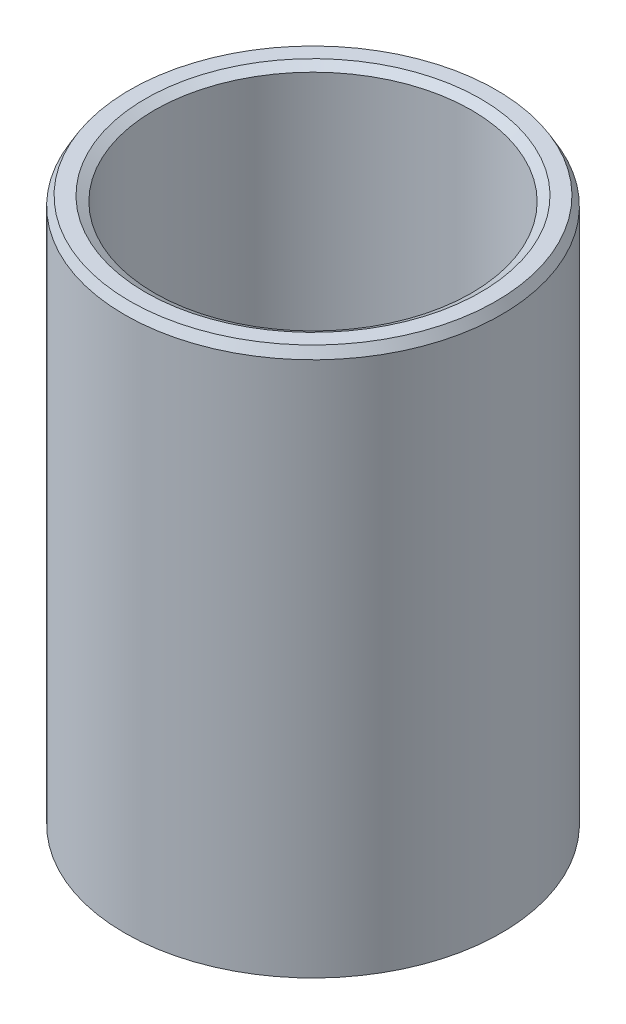
ISO-10303-21;
HEADER;
FILE_DESCRIPTION(('STEP AP214'),'2;1');
FILE_NAME('part.step','',(''),(''),'','','');
FILE_SCHEMA(('AUTOMOTIVE_DESIGN { 1 0 10303 214 1 1 1 1 }'));
ENDSEC;
DATA;
#1=APPLICATION_CONTEXT('core data for automotive mechanical design processes');
#2=APPLICATION_PROTOCOL_DEFINITION('international standard','automotive_design',2000,#1);
#3=PRODUCT_CONTEXT('',#1,'mechanical');
#4=PRODUCT('Part','Part','',(#3));
#5=PRODUCT_RELATED_PRODUCT_CATEGORY('part','',(#4));
#6=PRODUCT_DEFINITION_FORMATION('','',#4);
#7=PRODUCT_DEFINITION_CONTEXT('part definition',#1,'design');
#8=PRODUCT_DEFINITION('design','',#6,#7);
#9=PRODUCT_DEFINITION_SHAPE('','',#8);
#10=(LENGTH_UNIT() NAMED_UNIT(*) SI_UNIT(.MILLI.,.METRE.));
#11=(NAMED_UNIT(*) PLANE_ANGLE_UNIT() SI_UNIT($,.RADIAN.));
#12=(NAMED_UNIT(*) SI_UNIT($,.STERADIAN.) SOLID_ANGLE_UNIT());
#13=UNCERTAINTY_MEASURE_WITH_UNIT(LENGTH_MEASURE(1.E-05),#10,'distance_accuracy_value','');
#14=(GEOMETRIC_REPRESENTATION_CONTEXT(3) GLOBAL_UNCERTAINTY_ASSIGNED_CONTEXT((#13)) GLOBAL_UNIT_ASSIGNED_CONTEXT((#10,
#11,#12)) REPRESENTATION_CONTEXT('',''));
#15=CARTESIAN_POINT('',(0.,0.,0.));
#16=DIRECTION('',(0.,0.,1.));
#17=DIRECTION('',(1.,0.,0.));
#18=AXIS2_PLACEMENT_3D('',#15,#16,#17);
#19=CARTESIAN_POINT('',(0.,72.9566128437135,0.));
#20=DIRECTION('',(0.,-1.,0.));
#21=DIRECTION('',(0.,0.,-1.));
#22=AXIS2_PLACEMENT_3D('',#19,#20,#21);
#23=CYLINDRICAL_SURFACE('',#22,25.);
#24=CARTESIAN_POINT('',(0.,0.698276191843289,0.));
#25=DIRECTION('',(0.,1.,0.));
#26=DIRECTION('',(0.,0.,1.));
#27=AXIS2_PLACEMENT_3D('',#24,#25,#26);
#28=CIRCLE('',#27,25.);
#29=CARTESIAN_POINT('',(0.,0.698276191843289,25.));
#30=VERTEX_POINT('',#29);
#31=EDGE_CURVE('E10',#30,#30,#28,.T.);
#32=ORIENTED_EDGE('',*,*,#31,.T.);
#33=EDGE_LOOP('',(#32));
#34=FACE_BOUND('',#33,.T.);
#35=CARTESIAN_POINT('',(0.,71.7471630017252,0.));
#36=DIRECTION('',(0.,1.,0.));
#37=DIRECTION('',(0.,0.,1.));
#38=AXIS2_PLACEMENT_3D('',#35,#36,#37);
#39=CIRCLE('',#38,25.);
#40=CARTESIAN_POINT('',(0.,71.7471630017252,25.));
#41=VERTEX_POINT('',#40);
#42=EDGE_CURVE('E50',#41,#41,#39,.F.);
#43=ORIENTED_EDGE('',*,*,#42,.T.);
#44=EDGE_LOOP('',(#43));
#45=FACE_BOUND('',#44,.T.);
#46=ADVANCED_FACE('F39',(#34,#45),#23,.T.);
#47=CARTESIAN_POINT('',(0.,72.9566128437135,0.));
#48=DIRECTION('',(0.,1.,0.));
#49=DIRECTION('',(0.,0.,1.));
#50=AXIS2_PLACEMENT_3D('',#47,#48,#49);
#51=PLANE('',#50);
#52=CARTESIAN_POINT('',(0.,72.9566128437135,0.));
#53=DIRECTION('',(0.,1.,0.));
#54=DIRECTION('',(0.,0.,1.));
#55=AXIS2_PLACEMENT_3D('',#52,#53,#54);
#56=CIRCLE('',#55,22.2442396391999);
#57=CARTESIAN_POINT('',(0.,72.9566128437134,22.2442396391999));
#58=VERTEX_POINT('',#57);
#59=EDGE_CURVE('E58',#58,#58,#56,.F.);
#60=ORIENTED_EDGE('',*,*,#59,.T.);
#61=EDGE_LOOP('',(#60));
#62=FACE_BOUND('',#61,.T.);
#63=CARTESIAN_POINT('',(0.,72.9566128437135,0.));
#64=DIRECTION('',(0.,1.,0.));
#65=DIRECTION('',(0.,0.,1.));
#66=AXIS2_PLACEMENT_3D('',#63,#64,#65);
#67=CIRCLE('',#66,24.3017238081567);
#68=CARTESIAN_POINT('',(0.,72.9566128437135,24.3017238081567));
#69=VERTEX_POINT('',#68);
#70=EDGE_CURVE('E61',#69,#69,#67,.T.);
#71=ORIENTED_EDGE('',*,*,#70,.T.);
#72=EDGE_LOOP('',(#71));
#73=FACE_BOUND('',#72,.T.);
#74=ADVANCED_FACE('F88',(#62,#73),#51,.T.);
#75=CARTESIAN_POINT('',(0.,0.,0.));
#76=DIRECTION('',(0.,1.,0.));
#77=DIRECTION('',(0.,0.,1.));
#78=AXIS2_PLACEMENT_3D('',#75,#76,#77);
#79=PLANE('',#78);
#80=CARTESIAN_POINT('',(0.,0.,0.));
#81=DIRECTION('',(0.,1.,0.));
#82=DIRECTION('',(0.,0.,1.));
#83=AXIS2_PLACEMENT_3D('',#80,#81,#82);
#84=CIRCLE('',#83,21.7330659890549);
#85=CARTESIAN_POINT('',(0.,0.,21.7330659890549));
#86=VERTEX_POINT('',#85);
#87=EDGE_CURVE('E51',#86,#86,#84,.T.);
#88=ORIENTED_EDGE('',*,*,#87,.T.);
#89=EDGE_LOOP('',(#88));
#90=FACE_BOUND('',#89,.T.);
#91=CARTESIAN_POINT('',(0.,0.,0.));
#92=DIRECTION('',(0.,1.,0.));
#93=DIRECTION('',(0.,0.,1.));
#94=AXIS2_PLACEMENT_3D('',#91,#92,#93);
#95=CIRCLE('',#94,23.7905501580117);
#96=CARTESIAN_POINT('',(0.,0.,23.7905501580117));
#97=VERTEX_POINT('',#96);
#98=EDGE_CURVE('E54',#97,#97,#95,.F.);
#99=ORIENTED_EDGE('',*,*,#98,.T.);
#100=EDGE_LOOP('',(#99));
#101=FACE_BOUND('',#100,.T.);
#102=ADVANCED_FACE('F83',(#90,#101),#79,.F.);
#103=CARTESIAN_POINT('',(0.,72.9566128437135,0.));
#104=DIRECTION('',(0.,-1.,0.));
#105=DIRECTION('',(0.,0.,-1.));
#106=AXIS2_PLACEMENT_3D('',#103,#104,#105);
#107=CYLINDRICAL_SURFACE('',#106,21.0347897972116);
#108=CARTESIAN_POINT('',(0.,72.2583366518702,0.));
#109=DIRECTION('',(0.,1.,0.));
#110=DIRECTION('',(0.,0.,1.));
#111=AXIS2_PLACEMENT_3D('',#108,#109,#110);
#112=CIRCLE('',#111,21.0347897972116);
#113=CARTESIAN_POINT('',(0.,72.2583366518702,21.0347897972116));
#114=VERTEX_POINT('',#113);
#115=EDGE_CURVE('E67',#114,#114,#112,.T.);
#116=ORIENTED_EDGE('',*,*,#115,.T.);
#117=EDGE_LOOP('',(#116));
#118=FACE_BOUND('',#117,.T.);
#119=CARTESIAN_POINT('',(0.,1.20944984198829,0.));
#120=DIRECTION('',(0.,1.,0.));
#121=DIRECTION('',(0.,0.,1.));
#122=AXIS2_PLACEMENT_3D('',#119,#120,#121);
#123=CIRCLE('',#122,21.0347897972116);
#124=CARTESIAN_POINT('',(0.,1.20944984198829,21.0347897972116));
#125=VERTEX_POINT('',#124);
#126=EDGE_CURVE('E69',#125,#125,#123,.F.);
#127=ORIENTED_EDGE('',*,*,#126,.T.);
#128=EDGE_LOOP('',(#127));
#129=FACE_BOUND('',#128,.T.);
#130=ADVANCED_FACE('F71',(#118,#129),#107,.F.);
#131=CARTESIAN_POINT('',(0.,72.2583366518702,0.));
#132=DIRECTION('',(0.,1.,0.));
#133=DIRECTION('',(0.,0.,1.));
#134=AXIS2_PLACEMENT_3D('',#131,#132,#133);
#135=CONICAL_SURFACE('',#134,21.0347897972116,1.0471975511966);
#136=CARTESIAN_POINT('',(0.,72.9566128437134,22.2442396391999));
#137=CARTESIAN_POINT('',(0.,72.9493391333818,22.2316412033458));
#138=CARTESIAN_POINT('',(0.,72.9420654230501,22.2190427674918));
#139=CARTESIAN_POINT('',(0.,72.9275180023867,22.1938458957837));
#140=CARTESIAN_POINT('',(0.,72.9202442920549,22.1812474599297));
#141=CARTESIAN_POINT('',(0.,72.9056968713916,22.1560505882216));
#142=CARTESIAN_POINT('',(0.,72.8984231610599,22.1434521523675));
#143=CARTESIAN_POINT('',(0.,72.8838757403964,22.1182552806594));
#144=CARTESIAN_POINT('',(0.,72.8766020300647,22.1056568448054));
#145=CARTESIAN_POINT('',(0.,72.8620546094013,22.0804599730973));
#146=CARTESIAN_POINT('',(0.,72.8547808990697,22.0678615372432));
#147=CARTESIAN_POINT('',(0.,72.8402334784062,22.0426646655352));
#148=CARTESIAN_POINT('',(0.,72.8329597680745,22.0300662296811));
#149=CARTESIAN_POINT('',(0.,72.8184123474111,22.004869357973));
#150=CARTESIAN_POINT('',(0.,72.8111386370794,21.992270922119));
#151=CARTESIAN_POINT('',(0.,72.796591216416,21.9670740504109));
#152=CARTESIAN_POINT('',(0.,72.7893175060843,21.9544756145568));
#153=CARTESIAN_POINT('',(0.,72.7747700854209,21.9292787428488));
#154=CARTESIAN_POINT('',(0.,72.7674963750892,21.9166803069947));
#155=CARTESIAN_POINT('',(0.,72.7529489544258,21.8914834352866));
#156=CARTESIAN_POINT('',(0.,72.7456752440941,21.8788849994326));
#157=CARTESIAN_POINT('',(0.,72.7311278234307,21.8536881277245));
#158=CARTESIAN_POINT('',(0.,72.723854113099,21.8410896918704));
#159=CARTESIAN_POINT('',(0.,72.7093066924356,21.8158928201624));
#160=CARTESIAN_POINT('',(0.,72.7020329821039,21.8032943843083));
#161=CARTESIAN_POINT('',(0.,72.6874855614405,21.7780975126002));
#162=CARTESIAN_POINT('',(0.,72.6802118511088,21.7654990767462));
#163=CARTESIAN_POINT('',(0.,72.6656644304454,21.7403022050381));
#164=CARTESIAN_POINT('',(0.,72.6583907201137,21.727703769184));
#165=CARTESIAN_POINT('',(0.,72.6438432994503,21.7025068974759));
#166=CARTESIAN_POINT('',(0.,72.6365695891186,21.6899084616219));
#167=CARTESIAN_POINT('',(0.,72.6220221684552,21.6647115899138));
#168=CARTESIAN_POINT('',(0.,72.6147484581235,21.6521131540598));
#169=CARTESIAN_POINT('',(0.,72.6002010374601,21.6269162823517));
#170=CARTESIAN_POINT('',(0.,72.5929273271284,21.6143178464976));
#171=CARTESIAN_POINT('',(0.,72.578379906465,21.5891209747895));
#172=CARTESIAN_POINT('',(0.,72.5711061961333,21.5765225389355));
#173=CARTESIAN_POINT('',(0.,72.5565587754699,21.5513256672274));
#174=CARTESIAN_POINT('',(0.,72.5492850651382,21.5387272313734));
#175=CARTESIAN_POINT('',(0.,72.5347376444748,21.5135303596653));
#176=CARTESIAN_POINT('',(0.,72.5274639341431,21.5009319238112));
#177=CARTESIAN_POINT('',(0.,72.5129165134797,21.4757350521031));
#178=CARTESIAN_POINT('',(0.,72.505642803148,21.4631366162491));
#179=CARTESIAN_POINT('',(0.,72.4910953824846,21.437939744541));
#180=CARTESIAN_POINT('',(0.,72.4838216721529,21.425341308687));
#181=CARTESIAN_POINT('',(0.,72.4692742514895,21.4001444369789));
#182=CARTESIAN_POINT('',(0.,72.4620005411578,21.3875460011248));
#183=CARTESIAN_POINT('',(0.,72.4474531204944,21.3623491294167));
#184=CARTESIAN_POINT('',(0.,72.4401794101627,21.3497506935627));
#185=CARTESIAN_POINT('',(0.,72.4256319894993,21.3245538218546));
#186=CARTESIAN_POINT('',(0.,72.4183582791676,21.3119553860006));
#187=CARTESIAN_POINT('',(0.,72.4038108585042,21.2867585142925));
#188=CARTESIAN_POINT('',(0.,72.3965371481725,21.2741600784384));
#189=CARTESIAN_POINT('',(0.,72.3819897275091,21.2489632067303));
#190=CARTESIAN_POINT('',(0.,72.3747160171774,21.2363647708763));
#191=CARTESIAN_POINT('',(0.,72.360168596514,21.2111678991682));
#192=CARTESIAN_POINT('',(0.,72.3528948861823,21.1985694633142));
#193=CARTESIAN_POINT('',(0.,72.3383474655189,21.1733725916061));
#194=CARTESIAN_POINT('',(0.,72.3310737551872,21.160774155752));
#195=CARTESIAN_POINT('',(0.,72.3165263345238,21.1355772840439));
#196=CARTESIAN_POINT('',(0.,72.3092526241921,21.1229788481899));
#197=CARTESIAN_POINT('',(0.,72.2947052035287,21.0977819764818));
#198=CARTESIAN_POINT('',(0.,72.287431493197,21.0851835406278));
#199=CARTESIAN_POINT('',(0.,72.2728840725336,21.0599866689197));
#200=CARTESIAN_POINT('',(0.,72.2656103622019,21.0473882330656));
#201=CARTESIAN_POINT('',(0.,72.2583366518702,21.0347897972116));
#202=B_SPLINE_CURVE_WITH_KNOTS('',3,(#136,#137,#138,#139,#140,#141,#142,#143,#144,#145,#146,
#147,#148,#149,#150,#151,#152,#153,#154,#155,#156,#157,#158,#159,#160,#161,#162,#163,#164,#165,
#166,#167,#168,#169,#170,#171,#172,#173,#174,#175,#176,#177,#178,#179,#180,#181,#182,#183,#184,
#185,#186,#187,#188,#189,#190,#191,#192,#193,#194,#195,#196,#197,#198,#199,#200,#201),
.UNSPECIFIED.,.F.,.F.,(4,2,2,2,2,2,2,2,2,2,2,2,2,2,2,2,2,2,2,2,2,2,2,2,2,2,2,2,2,2,2,2,4),(0.,
0.0436422619902001,0.0872845239804101,0.13092678597061,0.17456904796082,0.218211309951023,
0.26185357194123,0.305495833931433,0.349138095921643,0.39278035791185,0.436422619902053,
0.480064881892263,0.523707143882463,0.567349405872673,0.610991667862877,0.654633929853083,
0.698276191843293,0.741918453833497,0.785560715823703,0.829202977813907,0.872845239804117,
0.916487501794317,0.960129763784527,1.00377202577473,1.04741428776494,1.09105654975515,
1.13469881174535,1.17834107373556,1.22198333572576,1.26562559771597,1.30926785970617,
1.35291012169638,1.39655238368658),.UNSPECIFIED.);
#203=EDGE_CURVE('BSEAM77',#58,#114,#202,.T.);
#204=ORIENTED_EDGE('',*,*,#59,.F.);
#205=ORIENTED_EDGE('',*,*,#115,.F.);
#206=ORIENTED_EDGE('',*,*,#203,.T.);
#207=ORIENTED_EDGE('',*,*,#203,.F.);
#208=EDGE_LOOP('',(#204,#206,#205,#207));
#209=FACE_BOUND('',#208,.T.);
#210=ADVANCED_FACE('F77',(#209),#135,.F.);
#211=CARTESIAN_POINT('',(0.,0.,0.));
#212=DIRECTION('',(0.,-1.,0.));
#213=DIRECTION('',(0.,0.,-1.));
#214=AXIS2_PLACEMENT_3D('',#211,#212,#213);
#215=CONICAL_SURFACE('',#214,21.7330659890549,0.523598775598293);
#216=ORIENTED_EDGE('',*,*,#126,.F.);
#217=EDGE_LOOP('',(#216));
#218=FACE_BOUND('',#217,.T.);
#219=ORIENTED_EDGE('',*,*,#87,.F.);
#220=EDGE_LOOP('',(#219));
#221=FACE_BOUND('',#220,.T.);
#222=ADVANCED_FACE('F73',(#218,#221),#215,.F.);
#223=CARTESIAN_POINT('',(0.,0.698276191843289,0.));
#224=DIRECTION('',(0.,1.,0.));
#225=DIRECTION('',(0.,0.,1.));
#226=AXIS2_PLACEMENT_3D('',#223,#224,#225);
#227=CONICAL_SURFACE('',#226,25.,1.0471975511966);
#228=CARTESIAN_POINT('',(0.,0.,23.7905501580117));
#229=CARTESIAN_POINT('',(0.,0.00727371033169997,23.8031485938658));
#230=CARTESIAN_POINT('',(0.,0.0145474206634012,23.8157470297198));
#231=CARTESIAN_POINT('',(0.,0.0290948413268036,23.8409439014279));
#232=CARTESIAN_POINT('',(0.,0.0363685516585048,23.8535423372819));
#233=CARTESIAN_POINT('',(0.,0.0509159723219066,23.87873920899));
#234=CARTESIAN_POINT('',(0.,0.058189682653607,23.8913376448441));
#235=CARTESIAN_POINT('',(0.,0.0727371033170089,23.9165345165522));
#236=CARTESIAN_POINT('',(0.,0.0800108136487103,23.9291329524062));
#237=CARTESIAN_POINT('',(0.,0.0945582343121122,23.9543298241143));
#238=CARTESIAN_POINT('',(0.,0.101831944643813,23.9669282599683));
#239=CARTESIAN_POINT('',(0.,0.116379365307214,23.9921251316764));
#240=CARTESIAN_POINT('',(0.,0.123653075638916,24.0047235675305));
#241=CARTESIAN_POINT('',(0.,0.138200496302318,24.0299204392386));
#242=CARTESIAN_POINT('',(0.,0.145474206634018,24.0425188750926));
#243=CARTESIAN_POINT('',(0.,0.16002162729742,24.0677157468007));
#244=CARTESIAN_POINT('',(0.,0.167295337629121,24.0803141826547));
#245=CARTESIAN_POINT('',(0.,0.181842758292523,24.1055110543628));
#246=CARTESIAN_POINT('',(0.,0.189116468624224,24.1181094902169));
#247=CARTESIAN_POINT('',(0.,0.203663889287626,24.143306361925));
#248=CARTESIAN_POINT('',(0.,0.210937599619326,24.155904797779));
#249=CARTESIAN_POINT('',(0.,0.225485020282728,24.1811016694871));
#250=CARTESIAN_POINT('',(0.,0.23275873061443,24.1937001053411));
#251=CARTESIAN_POINT('',(0.,0.247306151277832,24.2188969770492));
#252=CARTESIAN_POINT('',(0.,0.254579861609532,24.2314954129033));
#253=CARTESIAN_POINT('',(0.,0.269127282272934,24.2566922846114));
#254=CARTESIAN_POINT('',(0.,0.276400992604635,24.2692907204654));
#255=CARTESIAN_POINT('',(0.,0.290948413268037,24.2944875921735));
#256=CARTESIAN_POINT('',(0.,0.298222123599738,24.3070860280275));
#257=CARTESIAN_POINT('',(0.,0.312769544263139,24.3322828997356));
#258=CARTESIAN_POINT('',(0.,0.320043254594841,24.3448813355897));
#259=CARTESIAN_POINT('',(0.,0.334590675258243,24.3700782072978));
#260=CARTESIAN_POINT('',(0.,0.341864385589943,24.3826766431518));
#261=CARTESIAN_POINT('',(0.,0.356411806253345,24.4078735148599));
#262=CARTESIAN_POINT('',(0.,0.363685516585046,24.4204719507139));
#263=CARTESIAN_POINT('',(0.,0.378232937248448,24.445668822422));
#264=CARTESIAN_POINT('',(0.,0.385506647580149,24.4582672582761));
#265=CARTESIAN_POINT('',(0.,0.400054068243551,24.4834641299842));
#266=CARTESIAN_POINT('',(0.,0.407327778575251,24.4960625658382));
#267=CARTESIAN_POINT('',(0.,0.421875199238654,24.5212594375463));
#268=CARTESIAN_POINT('',(0.,0.429148909570355,24.5338578734003));
#269=CARTESIAN_POINT('',(0.,0.443696330233757,24.5590547451084));
#270=CARTESIAN_POINT('',(0.,0.450970040565457,24.5716531809625));
#271=CARTESIAN_POINT('',(0.,0.465517461228859,24.5968500526706));
#272=CARTESIAN_POINT('',(0.,0.47279117156056,24.6094484885246));
#273=CARTESIAN_POINT('',(0.,0.487338592223962,24.6346453602327));
#274=CARTESIAN_POINT('',(0.,0.494612302555663,24.6472437960867));
#275=CARTESIAN_POINT('',(0.,0.509159723219064,24.6724406677948));
#276=CARTESIAN_POINT('',(0.,0.516433433550766,24.6850391036489));
#277=CARTESIAN_POINT('',(0.,0.530980854214168,24.710235975357));
#278=CARTESIAN_POINT('',(0.,0.538254564545869,24.722834411211));
#279=CARTESIAN_POINT('',(0.,0.55280198520927,24.7480312829191));
#280=CARTESIAN_POINT('',(0.,0.560075695540971,24.7606297187732));
#281=CARTESIAN_POINT('',(0.,0.574623116204373,24.7858265904812));
#282=CARTESIAN_POINT('',(0.,0.581896826536074,24.7984250263353));
#283=CARTESIAN_POINT('',(0.,0.596444247199476,24.8236218980434));
#284=CARTESIAN_POINT('',(0.,0.603717957531177,24.8362203338974));
#285=CARTESIAN_POINT('',(0.,0.618265378194578,24.8614172056055));
#286=CARTESIAN_POINT('',(0.,0.62553908852628,24.8740156414596));
#287=CARTESIAN_POINT('',(0.,0.640086509189682,24.8992125131676));
#288=CARTESIAN_POINT('',(0.,0.647360219521382,24.9118109490217));
#289=CARTESIAN_POINT('',(0.,0.661907640184784,24.9370078207298));
#290=CARTESIAN_POINT('',(0.,0.669181350516485,24.9496062565838));
#291=CARTESIAN_POINT('',(0.,0.683728771179888,24.9748031282919));
#292=CARTESIAN_POINT('',(0.,0.691002481511589,24.987401564146));
#293=CARTESIAN_POINT('',(0.,0.698276191843289,25.));
#294=B_SPLINE_CURVE_WITH_KNOTS('',3,(#228,#229,#230,#231,#232,#233,#234,#235,#236,#237,#238,
#239,#240,#241,#242,#243,#244,#245,#246,#247,#248,#249,#250,#251,#252,#253,#254,#255,#256,#257,
#258,#259,#260,#261,#262,#263,#264,#265,#266,#267,#268,#269,#270,#271,#272,#273,#274,#275,#276,
#277,#278,#279,#280,#281,#282,#283,#284,#285,#286,#287,#288,#289,#290,#291,#292,#293),
.UNSPECIFIED.,.F.,.F.,(4,2,2,2,2,2,2,2,2,2,2,2,2,2,2,2,2,2,2,2,2,2,2,2,2,2,2,2,2,2,2,2,4),(0.,
0.043642261990207,0.0872845239804109,0.130926785970618,0.174569047960822,0.218211309951029,
0.261853571941233,0.30549583393144,0.349138095921644,0.392780357911851,0.436422619902058,
0.480064881892262,0.523707143882469,0.567349405872673,0.61099166786288,0.654633929853084,
0.698276191843291,0.741918453833495,0.785560715823701,0.829202977813908,0.872845239804112,
0.916487501794319,0.960129763784523,1.00377202577473,1.04741428776493,1.09105654975514,
1.13469881174535,1.17834107373555,1.22198333572576,1.26562559771596,1.30926785970617,
1.35291012169637,1.39655238368658),.UNSPECIFIED.);
#295=EDGE_CURVE('BSEAM76',#97,#30,#294,.T.);
#296=ORIENTED_EDGE('',*,*,#98,.F.);
#297=ORIENTED_EDGE('',*,*,#31,.F.);
#298=ORIENTED_EDGE('',*,*,#295,.T.);
#299=ORIENTED_EDGE('',*,*,#295,.F.);
#300=EDGE_LOOP('',(#296,#298,#297,#299));
#301=FACE_BOUND('',#300,.T.);
#302=ADVANCED_FACE('F76',(#301),#227,.T.);
#303=CARTESIAN_POINT('',(0.,72.9566128437135,0.));
#304=DIRECTION('',(0.,-1.,0.));
#305=DIRECTION('',(0.,0.,-1.));
#306=AXIS2_PLACEMENT_3D('',#303,#304,#305);
#307=CONICAL_SURFACE('',#306,24.3017238081567,0.523598775598303);
#308=ORIENTED_EDGE('',*,*,#42,.F.);
#309=EDGE_LOOP('',(#308));
#310=FACE_BOUND('',#309,.T.);
#311=ORIENTED_EDGE('',*,*,#70,.F.);
#312=EDGE_LOOP('',(#311));
#313=FACE_BOUND('',#312,.T.);
#314=ADVANCED_FACE('F45',(#310,#313),#307,.T.);
#315=CLOSED_SHELL('',(#46,#74,#102,#130,#210,#222,#302,#314));
#316=MANIFOLD_SOLID_BREP('B2',#315);
#317=ADVANCED_BREP_SHAPE_REPRESENTATION('',(#18,#316),#14);
#318=SHAPE_DEFINITION_REPRESENTATION(#9,#317);
ENDSEC;
END-ISO-10303-21;
